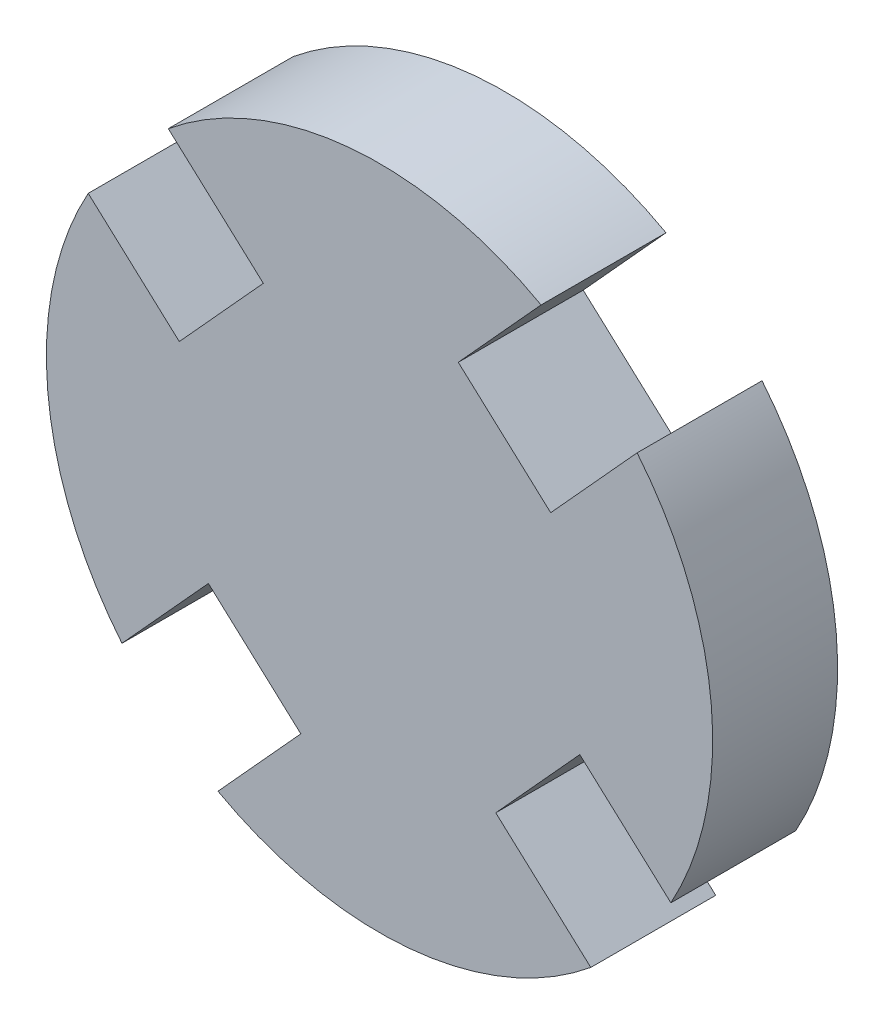
ISO-10303-21;
HEADER;
FILE_DESCRIPTION(('STEP AP214'),'2;1');
FILE_NAME('part.step','',(''),(''),'','','');
FILE_SCHEMA(('AUTOMOTIVE_DESIGN { 1 0 10303 214 1 1 1 1 }'));
ENDSEC;
DATA;
#1=APPLICATION_CONTEXT('core data for automotive mechanical design processes');
#2=APPLICATION_PROTOCOL_DEFINITION('international standard','automotive_design',2000,#1);
#3=PRODUCT_CONTEXT('',#1,'mechanical');
#4=PRODUCT('Part','Part','',(#3));
#5=PRODUCT_RELATED_PRODUCT_CATEGORY('part','',(#4));
#6=PRODUCT_DEFINITION_FORMATION('','',#4);
#7=PRODUCT_DEFINITION_CONTEXT('part definition',#1,'design');
#8=PRODUCT_DEFINITION('design','',#6,#7);
#9=PRODUCT_DEFINITION_SHAPE('','',#8);
#10=(LENGTH_UNIT() NAMED_UNIT(*) SI_UNIT(.MILLI.,.METRE.));
#11=(NAMED_UNIT(*) PLANE_ANGLE_UNIT() SI_UNIT($,.RADIAN.));
#12=(NAMED_UNIT(*) SI_UNIT($,.STERADIAN.) SOLID_ANGLE_UNIT());
#13=UNCERTAINTY_MEASURE_WITH_UNIT(LENGTH_MEASURE(1.E-05),#10,'distance_accuracy_value','');
#14=(GEOMETRIC_REPRESENTATION_CONTEXT(3) GLOBAL_UNCERTAINTY_ASSIGNED_CONTEXT((#13)) GLOBAL_UNIT_ASSIGNED_CONTEXT((#10,
#11,#12)) REPRESENTATION_CONTEXT('',''));
#15=CARTESIAN_POINT('',(0.,0.,0.));
#16=DIRECTION('',(0.,0.,1.));
#17=DIRECTION('',(1.,0.,0.));
#18=AXIS2_PLACEMENT_3D('',#15,#16,#17);
#19=CARTESIAN_POINT('',(-4.80888952143008,1.8906563862003,3.));
#20=DIRECTION('',(-0.672706316973039,-0.739909596575534,0.));
#21=DIRECTION('',(0.739909596575534,-0.672706316973039,0.));
#22=AXIS2_PLACEMENT_3D('',#19,#20,#21);
#23=PLANE('',#22);
#24=DIRECTION('',(0.,0.,1.));
#25=VECTOR('',#24,1.);
#26=CARTESIAN_POINT('',(-6.99639982832374,3.87948314111964,0.));
#27=LINE('',#26,#25);
#28=CARTESIAN_POINT('',(-6.99639982832374,3.87948314111964,3.));
#29=VERTEX_POINT('',#28);
#30=CARTESIAN_POINT('',(-6.99639982832374,3.87948314111964,0.));
#31=VERTEX_POINT('',#30);
#32=EDGE_CURVE('E59',#29,#31,#27,.F.);
#33=ORIENTED_EDGE('',*,*,#32,.F.);
#34=DIRECTION('',(-0.739909596575534,0.672706316973039,0.));
#35=VECTOR('',#34,1.);
#36=CARTESIAN_POINT('',(-4.80888952143008,1.8906563862003,3.));
#37=LINE('',#36,#35);
#38=CARTESIAN_POINT('',(-4.80888952143008,1.8906563862003,3.));
#39=VERTEX_POINT('',#38);
#40=EDGE_CURVE('E221',#39,#29,#37,.T.);
#41=ORIENTED_EDGE('',*,*,#40,.F.);
#42=DIRECTION('',(0.,0.,-1.));
#43=VECTOR('',#42,1.);
#44=CARTESIAN_POINT('',(-4.80888952143008,1.8906563862003,3.));
#45=LINE('',#44,#43);
#46=CARTESIAN_POINT('',(-4.80888952143008,1.8906563862003,0.));
#47=VERTEX_POINT('',#46);
#48=EDGE_CURVE('E166',#39,#47,#45,.T.);
#49=ORIENTED_EDGE('',*,*,#48,.T.);
#50=DIRECTION('',(-0.739909596575534,0.672706316973039,0.));
#51=VECTOR('',#50,1.);
#52=CARTESIAN_POINT('',(-4.80888952143008,1.8906563862003,0.));
#53=LINE('',#52,#51);
#54=EDGE_CURVE('E204',#47,#31,#53,.T.);
#55=ORIENTED_EDGE('',*,*,#54,.T.);
#56=EDGE_LOOP('',(#33,#41,#49,#55));
#57=FACE_BOUND('',#56,.T.);
#58=ADVANCED_FACE('F43',(#57),#23,.F.);
#59=CARTESIAN_POINT('',(-4.11038517592692,-2.79077057051095,3.));
#60=DIRECTION('',(0.739909596575534,-0.672706316973039,0.));
#61=DIRECTION('',(0.672706316973039,0.739909596575534,0.));
#62=AXIS2_PLACEMENT_3D('',#59,#60,#61);
#63=PLANE('',#62);
#64=DIRECTION('',(-0.672706316973039,-0.739909596575534,0.));
#65=VECTOR('',#64,1.);
#66=CARTESIAN_POINT('',(-4.11038517592692,-2.79077057051095,3.));
#67=LINE('',#66,#65);
#68=CARTESIAN_POINT('',(-4.11038517592692,-2.79077057051095,3.));
#69=VERTEX_POINT('',#68);
#70=CARTESIAN_POINT('',(-6.18559952570981,-5.07329858253371,3.));
#71=VERTEX_POINT('',#70);
#72=EDGE_CURVE('E227',#69,#71,#67,.T.);
#73=ORIENTED_EDGE('',*,*,#72,.T.);
#74=DIRECTION('',(0.,0.,1.));
#75=VECTOR('',#74,1.);
#76=CARTESIAN_POINT('',(-6.18559952570981,-5.07329858253371,0.));
#77=LINE('',#76,#75);
#78=CARTESIAN_POINT('',(-6.18559952570981,-5.07329858253371,0.));
#79=VERTEX_POINT('',#78);
#80=EDGE_CURVE('E285',#71,#79,#77,.F.);
#81=ORIENTED_EDGE('',*,*,#80,.T.);
#82=DIRECTION('',(-0.672706316973039,-0.739909596575534,0.));
#83=VECTOR('',#82,1.);
#84=CARTESIAN_POINT('',(-4.11038517592692,-2.79077057051095,0.));
#85=LINE('',#84,#83);
#86=CARTESIAN_POINT('',(-4.11038517592692,-2.79077057051095,0.));
#87=VERTEX_POINT('',#86);
#88=EDGE_CURVE('E201',#87,#79,#85,.T.);
#89=ORIENTED_EDGE('',*,*,#88,.F.);
#90=DIRECTION('',(0.,0.,-1.));
#91=VECTOR('',#90,1.);
#92=CARTESIAN_POINT('',(-4.11038517592692,-2.79077057051095,3.));
#93=LINE('',#92,#91);
#94=EDGE_CURVE('E209',#69,#87,#93,.T.);
#95=ORIENTED_EDGE('',*,*,#94,.F.);
#96=EDGE_LOOP('',(#73,#81,#89,#95));
#97=FACE_BOUND('',#96,.T.);
#98=ADVANCED_FACE('F284',(#97),#63,.T.);
#99=CARTESIAN_POINT('',(-1.8906563862003,-4.80888952143008,3.));
#100=DIRECTION('',(0.739909596575534,-0.672706316973039,0.));
#101=DIRECTION('',(0.672706316973039,0.739909596575534,0.));
#102=AXIS2_PLACEMENT_3D('',#99,#100,#101);
#103=PLANE('',#102);
#104=DIRECTION('',(0.,0.,1.));
#105=VECTOR('',#104,1.);
#106=CARTESIAN_POINT('',(-3.87948314111964,-6.99639982832374,0.));
#107=LINE('',#106,#105);
#108=CARTESIAN_POINT('',(-3.87948314111964,-6.99639982832374,3.));
#109=VERTEX_POINT('',#108);
#110=CARTESIAN_POINT('',(-3.87948314111964,-6.99639982832374,0.));
#111=VERTEX_POINT('',#110);
#112=EDGE_CURVE('E67',#109,#111,#107,.F.);
#113=ORIENTED_EDGE('',*,*,#112,.F.);
#114=DIRECTION('',(-0.672706316973039,-0.739909596575534,0.));
#115=VECTOR('',#114,1.);
#116=CARTESIAN_POINT('',(-1.8906563862003,-4.80888952143008,3.));
#117=LINE('',#116,#115);
#118=CARTESIAN_POINT('',(-1.8906563862003,-4.80888952143008,3.));
#119=VERTEX_POINT('',#118);
#120=EDGE_CURVE('E270',#119,#109,#117,.T.);
#121=ORIENTED_EDGE('',*,*,#120,.F.);
#122=DIRECTION('',(0.,0.,-1.));
#123=VECTOR('',#122,1.);
#124=CARTESIAN_POINT('',(-1.8906563862003,-4.80888952143008,3.));
#125=LINE('',#124,#123);
#126=CARTESIAN_POINT('',(-1.8906563862003,-4.80888952143008,0.));
#127=VERTEX_POINT('',#126);
#128=EDGE_CURVE('E211',#119,#127,#125,.T.);
#129=ORIENTED_EDGE('',*,*,#128,.T.);
#130=DIRECTION('',(-0.672706316973039,-0.739909596575534,0.));
#131=VECTOR('',#130,1.);
#132=CARTESIAN_POINT('',(-1.8906563862003,-4.80888952143008,0.));
#133=LINE('',#132,#131);
#134=EDGE_CURVE('E195',#127,#111,#133,.T.);
#135=ORIENTED_EDGE('',*,*,#134,.T.);
#136=EDGE_LOOP('',(#113,#121,#129,#135));
#137=FACE_BOUND('',#136,.T.);
#138=ADVANCED_FACE('F288',(#137),#103,.F.);
#139=CARTESIAN_POINT('',(2.79077057051095,-4.11038517592691,3.));
#140=DIRECTION('',(0.67270631697304,0.739909596575533,0.));
#141=DIRECTION('',(-0.739909596575533,0.67270631697304,0.));
#142=AXIS2_PLACEMENT_3D('',#139,#140,#141);
#143=PLANE('',#142);
#144=DIRECTION('',(0.739909596575533,-0.67270631697304,0.));
#145=VECTOR('',#144,1.);
#146=CARTESIAN_POINT('',(2.79077057051095,-4.11038517592691,3.));
#147=LINE('',#146,#145);
#148=CARTESIAN_POINT('',(2.79077057051095,-4.11038517592691,3.));
#149=VERTEX_POINT('',#148);
#150=CARTESIAN_POINT('',(5.07329858253371,-6.18559952570982,3.));
#151=VERTEX_POINT('',#150);
#152=EDGE_CURVE('E267',#149,#151,#147,.T.);
#153=ORIENTED_EDGE('',*,*,#152,.T.);
#154=DIRECTION('',(0.,0.,1.));
#155=VECTOR('',#154,1.);
#156=CARTESIAN_POINT('',(5.07329858253371,-6.18559952570982,0.));
#157=LINE('',#156,#155);
#158=CARTESIAN_POINT('',(5.07329858253371,-6.18559952570982,0.));
#159=VERTEX_POINT('',#158);
#160=EDGE_CURVE('E289',#151,#159,#157,.F.);
#161=ORIENTED_EDGE('',*,*,#160,.T.);
#162=DIRECTION('',(0.739909596575533,-0.67270631697304,0.));
#163=VECTOR('',#162,1.);
#164=CARTESIAN_POINT('',(2.79077057051095,-4.11038517592691,0.));
#165=LINE('',#164,#163);
#166=CARTESIAN_POINT('',(2.79077057051095,-4.11038517592691,0.));
#167=VERTEX_POINT('',#166);
#168=EDGE_CURVE('E192',#167,#159,#165,.T.);
#169=ORIENTED_EDGE('',*,*,#168,.F.);
#170=DIRECTION('',(0.,0.,-1.));
#171=VECTOR('',#170,1.);
#172=CARTESIAN_POINT('',(2.79077057051095,-4.11038517592691,3.));
#173=LINE('',#172,#171);
#174=EDGE_CURVE('E213',#149,#167,#173,.T.);
#175=ORIENTED_EDGE('',*,*,#174,.F.);
#176=EDGE_LOOP('',(#153,#161,#169,#175));
#177=FACE_BOUND('',#176,.T.);
#178=ADVANCED_FACE('F325',(#177),#143,.T.);
#179=CARTESIAN_POINT('',(4.80888952143008,-1.8906563862003,3.));
#180=DIRECTION('',(0.672706316973044,0.739909596575529,0.));
#181=DIRECTION('',(-0.739909596575529,0.672706316973044,0.));
#182=AXIS2_PLACEMENT_3D('',#179,#180,#181);
#183=PLANE('',#182);
#184=DIRECTION('',(0.,0.,1.));
#185=VECTOR('',#184,1.);
#186=CARTESIAN_POINT('',(6.99639982832373,-3.87948314111966,0.));
#187=LINE('',#186,#185);
#188=CARTESIAN_POINT('',(6.99639982832373,-3.87948314111966,3.));
#189=VERTEX_POINT('',#188);
#190=CARTESIAN_POINT('',(6.99639982832373,-3.87948314111966,0.));
#191=VERTEX_POINT('',#190);
#192=EDGE_CURVE('E160',#189,#191,#187,.F.);
#193=ORIENTED_EDGE('',*,*,#192,.F.);
#194=DIRECTION('',(0.739909596575529,-0.672706316973044,0.));
#195=VECTOR('',#194,1.);
#196=CARTESIAN_POINT('',(4.80888952143008,-1.8906563862003,3.));
#197=LINE('',#196,#195);
#198=CARTESIAN_POINT('',(4.80888952143008,-1.8906563862003,3.));
#199=VERTEX_POINT('',#198);
#200=EDGE_CURVE('E257',#199,#189,#197,.T.);
#201=ORIENTED_EDGE('',*,*,#200,.F.);
#202=DIRECTION('',(0.,0.,-1.));
#203=VECTOR('',#202,1.);
#204=CARTESIAN_POINT('',(4.80888952143008,-1.8906563862003,3.));
#205=LINE('',#204,#203);
#206=CARTESIAN_POINT('',(4.80888952143008,-1.8906563862003,0.));
#207=VERTEX_POINT('',#206);
#208=EDGE_CURVE('E215',#199,#207,#205,.T.);
#209=ORIENTED_EDGE('',*,*,#208,.T.);
#210=DIRECTION('',(0.739909596575529,-0.672706316973044,0.));
#211=VECTOR('',#210,1.);
#212=CARTESIAN_POINT('',(4.80888952143008,-1.8906563862003,0.));
#213=LINE('',#212,#211);
#214=EDGE_CURVE('E182',#207,#191,#213,.T.);
#215=ORIENTED_EDGE('',*,*,#214,.T.);
#216=EDGE_LOOP('',(#193,#201,#209,#215));
#217=FACE_BOUND('',#216,.T.);
#218=ADVANCED_FACE('F328',(#217),#183,.F.);
#219=CARTESIAN_POINT('',(4.11038517592691,2.79077057051095,3.));
#220=DIRECTION('',(-0.739909596575534,0.672706316973039,0.));
#221=DIRECTION('',(-0.672706316973039,-0.739909596575534,0.));
#222=AXIS2_PLACEMENT_3D('',#219,#220,#221);
#223=PLANE('',#222);
#224=DIRECTION('',(0.672706316973039,0.739909596575534,0.));
#225=VECTOR('',#224,1.);
#226=CARTESIAN_POINT('',(4.11038517592691,2.79077057051095,3.));
#227=LINE('',#226,#225);
#228=CARTESIAN_POINT('',(4.11038517592691,2.79077057051095,3.));
#229=VERTEX_POINT('',#228);
#230=CARTESIAN_POINT('',(6.18559952570981,5.07329858253371,3.));
#231=VERTEX_POINT('',#230);
#232=EDGE_CURVE('E174',#229,#231,#227,.T.);
#233=ORIENTED_EDGE('',*,*,#232,.T.);
#234=DIRECTION('',(0.,0.,1.));
#235=VECTOR('',#234,1.);
#236=CARTESIAN_POINT('',(6.18559952570981,5.07329858253371,0.));
#237=LINE('',#236,#235);
#238=CARTESIAN_POINT('',(6.18559952570981,5.07329858253371,0.));
#239=VERTEX_POINT('',#238);
#240=EDGE_CURVE('E157',#231,#239,#237,.F.);
#241=ORIENTED_EDGE('',*,*,#240,.T.);
#242=DIRECTION('',(0.672706316973039,0.739909596575534,0.));
#243=VECTOR('',#242,1.);
#244=CARTESIAN_POINT('',(4.11038517592691,2.79077057051095,0.));
#245=LINE('',#244,#243);
#246=CARTESIAN_POINT('',(4.11038517592691,2.79077057051095,0.));
#247=VERTEX_POINT('',#246);
#248=EDGE_CURVE('E171',#247,#239,#245,.T.);
#249=ORIENTED_EDGE('',*,*,#248,.F.);
#250=DIRECTION('',(0.,0.,-1.));
#251=VECTOR('',#250,1.);
#252=CARTESIAN_POINT('',(4.11038517592691,2.79077057051095,3.));
#253=LINE('',#252,#251);
#254=EDGE_CURVE('E217',#229,#247,#253,.T.);
#255=ORIENTED_EDGE('',*,*,#254,.F.);
#256=EDGE_LOOP('',(#233,#241,#249,#255));
#257=FACE_BOUND('',#256,.T.);
#258=ADVANCED_FACE('F170',(#257),#223,.T.);
#259=CARTESIAN_POINT('',(1.8906563862003,4.80888952143008,3.));
#260=DIRECTION('',(-0.739909596575529,0.672706316973044,0.));
#261=DIRECTION('',(-0.672706316973044,-0.739909596575529,0.));
#262=AXIS2_PLACEMENT_3D('',#259,#260,#261);
#263=PLANE('',#262);
#264=DIRECTION('',(0.,0.,1.));
#265=VECTOR('',#264,1.);
#266=CARTESIAN_POINT('',(3.87948314111965,6.99639982832373,0.));
#267=LINE('',#266,#265);
#268=CARTESIAN_POINT('',(3.87948314111966,6.99639982832373,3.));
#269=VERTEX_POINT('',#268);
#270=CARTESIAN_POINT('',(3.87948314111966,6.99639982832373,0.));
#271=VERTEX_POINT('',#270);
#272=EDGE_CURVE('E175',#269,#271,#267,.F.);
#273=ORIENTED_EDGE('',*,*,#272,.F.);
#274=DIRECTION('',(0.672706316973044,0.739909596575529,0.));
#275=VECTOR('',#274,1.);
#276=CARTESIAN_POINT('',(1.8906563862003,4.80888952143008,3.));
#277=LINE('',#276,#275);
#278=CARTESIAN_POINT('',(1.8906563862003,4.80888952143008,3.));
#279=VERTEX_POINT('',#278);
#280=EDGE_CURVE('E261',#279,#269,#277,.T.);
#281=ORIENTED_EDGE('',*,*,#280,.F.);
#282=DIRECTION('',(0.,0.,-1.));
#283=VECTOR('',#282,1.);
#284=CARTESIAN_POINT('',(1.8906563862003,4.80888952143008,3.));
#285=LINE('',#284,#283);
#286=CARTESIAN_POINT('',(1.8906563862003,4.80888952143008,0.));
#287=VERTEX_POINT('',#286);
#288=EDGE_CURVE('E219',#279,#287,#285,.T.);
#289=ORIENTED_EDGE('',*,*,#288,.T.);
#290=DIRECTION('',(0.672706316973044,0.739909596575529,0.));
#291=VECTOR('',#290,1.);
#292=CARTESIAN_POINT('',(1.8906563862003,4.80888952143008,0.));
#293=LINE('',#292,#291);
#294=EDGE_CURVE('E186',#287,#271,#293,.T.);
#295=ORIENTED_EDGE('',*,*,#294,.T.);
#296=EDGE_LOOP('',(#273,#281,#289,#295));
#297=FACE_BOUND('',#296,.T.);
#298=ADVANCED_FACE('F246',(#297),#263,.F.);
#299=CARTESIAN_POINT('',(-2.79077057051095,4.11038517592691,3.));
#300=DIRECTION('',(-0.672706316973044,-0.739909596575529,0.));
#301=DIRECTION('',(0.739909596575529,-0.672706316973044,0.));
#302=AXIS2_PLACEMENT_3D('',#299,#300,#301);
#303=PLANE('',#302);
#304=DIRECTION('',(-0.739909596575529,0.672706316973044,0.));
#305=VECTOR('',#304,1.);
#306=CARTESIAN_POINT('',(-2.79077057051095,4.11038517592691,3.));
#307=LINE('',#306,#305);
#308=CARTESIAN_POINT('',(-2.79077057051095,4.11038517592691,3.));
#309=VERTEX_POINT('',#308);
#310=CARTESIAN_POINT('',(-5.07329858253369,6.18559952570983,3.));
#311=VERTEX_POINT('',#310);
#312=EDGE_CURVE('E298',#309,#311,#307,.T.);
#313=ORIENTED_EDGE('',*,*,#312,.T.);
#314=DIRECTION('',(0.,0.,1.));
#315=VECTOR('',#314,1.);
#316=CARTESIAN_POINT('',(-5.07329858253369,6.18559952570983,0.));
#317=LINE('',#316,#315);
#318=CARTESIAN_POINT('',(-5.07329858253369,6.18559952570983,0.));
#319=VERTEX_POINT('',#318);
#320=EDGE_CURVE('E304',#311,#319,#317,.F.);
#321=ORIENTED_EDGE('',*,*,#320,.T.);
#322=DIRECTION('',(-0.739909596575529,0.672706316973044,0.));
#323=VECTOR('',#322,1.);
#324=CARTESIAN_POINT('',(-2.79077057051095,4.11038517592691,0.));
#325=LINE('',#324,#323);
#326=CARTESIAN_POINT('',(-2.79077057051095,4.11038517592691,0.));
#327=VERTEX_POINT('',#326);
#328=EDGE_CURVE('E241',#327,#319,#325,.T.);
#329=ORIENTED_EDGE('',*,*,#328,.F.);
#330=DIRECTION('',(0.,0.,-1.));
#331=VECTOR('',#330,1.);
#332=CARTESIAN_POINT('',(-2.79077057051095,4.11038517592691,3.));
#333=LINE('',#332,#331);
#334=EDGE_CURVE('E220',#309,#327,#333,.T.);
#335=ORIENTED_EDGE('',*,*,#334,.F.);
#336=EDGE_LOOP('',(#313,#321,#329,#335));
#337=FACE_BOUND('',#336,.T.);
#338=ADVANCED_FACE('F308',(#337),#303,.T.);
#339=CARTESIAN_POINT('',(0.,0.,3.));
#340=DIRECTION('',(0.,0.,1.));
#341=DIRECTION('',(1.,0.,0.));
#342=AXIS2_PLACEMENT_3D('',#339,#340,#341);
#343=PLANE('',#342);
#344=ORIENTED_EDGE('',*,*,#280,.T.);
#345=CARTESIAN_POINT('',(0.,0.,3.));
#346=DIRECTION('',(0.,0.,1.));
#347=DIRECTION('',(1.,0.,0.));
#348=AXIS2_PLACEMENT_3D('',#345,#346,#347);
#349=CIRCLE('',#348,8.);
#350=EDGE_CURVE('E302',#269,#311,#349,.T.);
#351=ORIENTED_EDGE('',*,*,#350,.T.);
#352=ORIENTED_EDGE('',*,*,#312,.F.);
#353=DIRECTION('',(0.672706316973039,0.739909596575534,0.));
#354=VECTOR('',#353,1.);
#355=CARTESIAN_POINT('',(-4.80888952143008,1.8906563862003,3.));
#356=LINE('',#355,#354);
#357=EDGE_CURVE('E207',#39,#309,#356,.T.);
#358=ORIENTED_EDGE('',*,*,#357,.F.);
#359=ORIENTED_EDGE('',*,*,#40,.T.);
#360=EDGE_CURVE('E281',#29,#71,#349,.T.);
#361=ORIENTED_EDGE('',*,*,#360,.T.);
#362=ORIENTED_EDGE('',*,*,#72,.F.);
#363=DIRECTION('',(-0.739909596575534,0.672706316973039,0.));
#364=VECTOR('',#363,1.);
#365=CARTESIAN_POINT('',(-1.8906563862003,-4.80888952143008,3.));
#366=LINE('',#365,#364);
#367=EDGE_CURVE('E234',#119,#69,#366,.T.);
#368=ORIENTED_EDGE('',*,*,#367,.F.);
#369=ORIENTED_EDGE('',*,*,#120,.T.);
#370=EDGE_CURVE('E461',#109,#151,#349,.T.);
#371=ORIENTED_EDGE('',*,*,#370,.T.);
#372=ORIENTED_EDGE('',*,*,#152,.F.);
#373=DIRECTION('',(-0.672706316973039,-0.739909596575533,0.));
#374=VECTOR('',#373,1.);
#375=CARTESIAN_POINT('',(4.80888952143008,-1.8906563862003,3.));
#376=LINE('',#375,#374);
#377=EDGE_CURVE('E259',#199,#149,#376,.T.);
#378=ORIENTED_EDGE('',*,*,#377,.F.);
#379=ORIENTED_EDGE('',*,*,#200,.T.);
#380=EDGE_CURVE('E256',#189,#231,#349,.T.);
#381=ORIENTED_EDGE('',*,*,#380,.T.);
#382=ORIENTED_EDGE('',*,*,#232,.F.);
#383=DIRECTION('',(0.739909596575534,-0.672706316973039,0.));
#384=VECTOR('',#383,1.);
#385=CARTESIAN_POINT('',(1.8906563862003,4.80888952143008,3.));
#386=LINE('',#385,#384);
#387=EDGE_CURVE('E253',#279,#229,#386,.T.);
#388=ORIENTED_EDGE('',*,*,#387,.F.);
#389=EDGE_LOOP('',(#344,#351,#352,#358,#359,#361,#362,#368,#369,#371,#372,#378,#379,#381,#382,#388));
#390=FACE_BOUND('',#389,.T.);
#391=ADVANCED_FACE('F254',(#390),#343,.T.);
#392=CARTESIAN_POINT('',(0.,0.,0.));
#393=DIRECTION('',(0.,0.,1.));
#394=DIRECTION('',(1.,0.,0.));
#395=AXIS2_PLACEMENT_3D('',#392,#393,#394);
#396=PLANE('',#395);
#397=CARTESIAN_POINT('',(0.,0.,0.));
#398=DIRECTION('',(0.,0.,1.));
#399=DIRECTION('',(1.,0.,0.));
#400=AXIS2_PLACEMENT_3D('',#397,#398,#399);
#401=CIRCLE('',#400,8.);
#402=EDGE_CURVE('E12',#271,#319,#401,.T.);
#403=ORIENTED_EDGE('',*,*,#402,.F.);
#404=ORIENTED_EDGE('',*,*,#294,.F.);
#405=DIRECTION('',(0.739909596575534,-0.672706316973039,0.));
#406=VECTOR('',#405,1.);
#407=CARTESIAN_POINT('',(1.8906563862003,4.80888952143008,0.));
#408=LINE('',#407,#406);
#409=EDGE_CURVE('E181',#287,#247,#408,.T.);
#410=ORIENTED_EDGE('',*,*,#409,.T.);
#411=ORIENTED_EDGE('',*,*,#248,.T.);
#412=EDGE_CURVE('E47',#191,#239,#401,.T.);
#413=ORIENTED_EDGE('',*,*,#412,.F.);
#414=ORIENTED_EDGE('',*,*,#214,.F.);
#415=DIRECTION('',(-0.672706316973039,-0.739909596575533,0.));
#416=VECTOR('',#415,1.);
#417=CARTESIAN_POINT('',(4.80888952143008,-1.8906563862003,0.));
#418=LINE('',#417,#416);
#419=EDGE_CURVE('E184',#207,#167,#418,.T.);
#420=ORIENTED_EDGE('',*,*,#419,.T.);
#421=ORIENTED_EDGE('',*,*,#168,.T.);
#422=EDGE_CURVE('E165',#111,#159,#401,.T.);
#423=ORIENTED_EDGE('',*,*,#422,.F.);
#424=ORIENTED_EDGE('',*,*,#134,.F.);
#425=DIRECTION('',(-0.739909596575534,0.672706316973039,0.));
#426=VECTOR('',#425,1.);
#427=CARTESIAN_POINT('',(-1.8906563862003,-4.80888952143008,0.));
#428=LINE('',#427,#426);
#429=EDGE_CURVE('E198',#127,#87,#428,.T.);
#430=ORIENTED_EDGE('',*,*,#429,.T.);
#431=ORIENTED_EDGE('',*,*,#88,.T.);
#432=EDGE_CURVE('E52',#31,#79,#401,.T.);
#433=ORIENTED_EDGE('',*,*,#432,.F.);
#434=ORIENTED_EDGE('',*,*,#54,.F.);
#435=DIRECTION('',(0.672706316973039,0.739909596575534,0.));
#436=VECTOR('',#435,1.);
#437=CARTESIAN_POINT('',(-4.80888952143008,1.8906563862003,0.));
#438=LINE('',#437,#436);
#439=EDGE_CURVE('E238',#47,#327,#438,.T.);
#440=ORIENTED_EDGE('',*,*,#439,.T.);
#441=ORIENTED_EDGE('',*,*,#328,.T.);
#442=EDGE_LOOP('',(#403,#404,#410,#411,#413,#414,#420,#421,#423,#424,#430,#431,#433,#434,#440,#441));
#443=FACE_BOUND('',#442,.T.);
#444=ADVANCED_FACE('F178',(#443),#396,.F.);
#445=CARTESIAN_POINT('',(-4.80888952143008,1.8906563862003,3.));
#446=DIRECTION('',(-0.739909596575534,0.672706316973039,0.));
#447=DIRECTION('',(-0.672706316973039,-0.739909596575534,0.));
#448=AXIS2_PLACEMENT_3D('',#445,#446,#447);
#449=PLANE('',#448);
#450=ORIENTED_EDGE('',*,*,#439,.F.);
#451=ORIENTED_EDGE('',*,*,#48,.F.);
#452=ORIENTED_EDGE('',*,*,#357,.T.);
#453=ORIENTED_EDGE('',*,*,#334,.T.);
#454=EDGE_LOOP('',(#450,#451,#452,#453));
#455=FACE_BOUND('',#454,.T.);
#456=ADVANCED_FACE('F45',(#455),#449,.T.);
#457=CARTESIAN_POINT('',(-1.8906563862003,-4.80888952143008,3.));
#458=DIRECTION('',(-0.672706316973039,-0.739909596575534,0.));
#459=DIRECTION('',(0.739909596575534,-0.672706316973039,0.));
#460=AXIS2_PLACEMENT_3D('',#457,#458,#459);
#461=PLANE('',#460);
#462=ORIENTED_EDGE('',*,*,#429,.F.);
#463=ORIENTED_EDGE('',*,*,#128,.F.);
#464=ORIENTED_EDGE('',*,*,#367,.T.);
#465=ORIENTED_EDGE('',*,*,#94,.T.);
#466=EDGE_LOOP('',(#462,#463,#464,#465));
#467=FACE_BOUND('',#466,.T.);
#468=ADVANCED_FACE('F276',(#467),#461,.T.);
#469=CARTESIAN_POINT('',(4.80888952143008,-1.8906563862003,3.));
#470=DIRECTION('',(0.739909596575534,-0.672706316973039,0.));
#471=DIRECTION('',(0.672706316973039,0.739909596575534,0.));
#472=AXIS2_PLACEMENT_3D('',#469,#470,#471);
#473=PLANE('',#472);
#474=ORIENTED_EDGE('',*,*,#419,.F.);
#475=ORIENTED_EDGE('',*,*,#208,.F.);
#476=ORIENTED_EDGE('',*,*,#377,.T.);
#477=ORIENTED_EDGE('',*,*,#174,.T.);
#478=EDGE_LOOP('',(#474,#475,#476,#477));
#479=FACE_BOUND('',#478,.T.);
#480=ADVANCED_FACE('F322',(#479),#473,.T.);
#481=CARTESIAN_POINT('',(1.8906563862003,4.80888952143008,3.));
#482=DIRECTION('',(0.672706316973039,0.739909596575534,0.));
#483=DIRECTION('',(-0.739909596575534,0.672706316973039,0.));
#484=AXIS2_PLACEMENT_3D('',#481,#482,#483);
#485=PLANE('',#484);
#486=ORIENTED_EDGE('',*,*,#409,.F.);
#487=ORIENTED_EDGE('',*,*,#288,.F.);
#488=ORIENTED_EDGE('',*,*,#387,.T.);
#489=ORIENTED_EDGE('',*,*,#254,.T.);
#490=EDGE_LOOP('',(#486,#487,#488,#489));
#491=FACE_BOUND('',#490,.T.);
#492=ADVANCED_FACE('F250',(#491),#485,.T.);
#493=CARTESIAN_POINT('',(0.,0.,0.));
#494=DIRECTION('',(0.,0.,1.));
#495=DIRECTION('',(1.,0.,0.));
#496=AXIS2_PLACEMENT_3D('',#493,#494,#495);
#497=CYLINDRICAL_SURFACE('',#496,8.);
#498=ORIENTED_EDGE('',*,*,#192,.T.);
#499=ORIENTED_EDGE('',*,*,#412,.T.);
#500=ORIENTED_EDGE('',*,*,#240,.F.);
#501=ORIENTED_EDGE('',*,*,#380,.F.);
#502=EDGE_LOOP('',(#498,#499,#500,#501));
#503=FACE_BOUND('',#502,.T.);
#504=ADVANCED_FACE('F156',(#503),#497,.T.);
#505=ORIENTED_EDGE('',*,*,#112,.T.);
#506=ORIENTED_EDGE('',*,*,#422,.T.);
#507=ORIENTED_EDGE('',*,*,#160,.F.);
#508=ORIENTED_EDGE('',*,*,#370,.F.);
#509=EDGE_LOOP('',(#505,#506,#507,#508));
#510=FACE_BOUND('',#509,.T.);
#511=ADVANCED_FACE('F352',(#510),#497,.T.);
#512=ORIENTED_EDGE('',*,*,#32,.T.);
#513=ORIENTED_EDGE('',*,*,#432,.T.);
#514=ORIENTED_EDGE('',*,*,#80,.F.);
#515=ORIENTED_EDGE('',*,*,#360,.F.);
#516=EDGE_LOOP('',(#512,#513,#514,#515));
#517=FACE_BOUND('',#516,.T.);
#518=ADVANCED_FACE('F349',(#517),#497,.T.);
#519=ORIENTED_EDGE('',*,*,#272,.T.);
#520=ORIENTED_EDGE('',*,*,#402,.T.);
#521=ORIENTED_EDGE('',*,*,#320,.F.);
#522=ORIENTED_EDGE('',*,*,#350,.F.);
#523=EDGE_LOOP('',(#519,#520,#521,#522));
#524=FACE_BOUND('',#523,.T.);
#525=ADVANCED_FACE('F351',(#524),#497,.T.);
#526=CLOSED_SHELL('',(#58,#98,#138,#178,#218,#258,#298,#338,#391,#444,#456,#468,#480,#492,#504,
#511,#518,#525));
#527=MANIFOLD_SOLID_BREP('B2',#526);
#528=ADVANCED_BREP_SHAPE_REPRESENTATION('',(#18,#527),#14);
#529=SHAPE_DEFINITION_REPRESENTATION(#9,#528);
ENDSEC;
END-ISO-10303-21;
